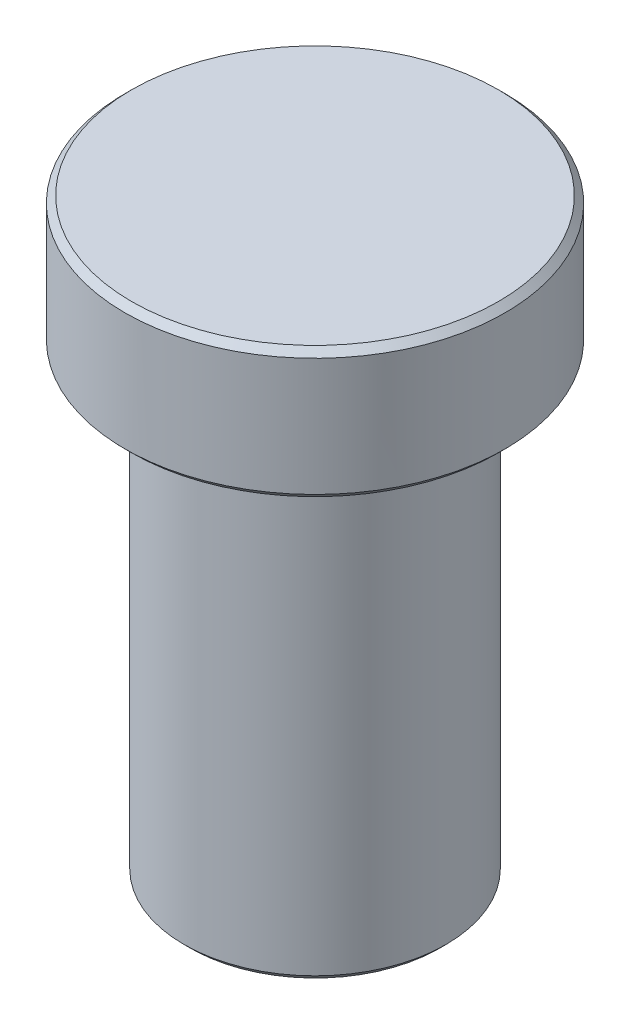
ISO-10303-21;
HEADER;
FILE_DESCRIPTION(('STEP AP214'),'2;1');
FILE_NAME('part.step','',(''),(''),'','','');
FILE_SCHEMA(('AUTOMOTIVE_DESIGN { 1 0 10303 214 1 1 1 1 }'));
ENDSEC;
DATA;
#1=APPLICATION_CONTEXT('core data for automotive mechanical design processes');
#2=APPLICATION_PROTOCOL_DEFINITION('international standard','automotive_design',2000,#1);
#3=PRODUCT_CONTEXT('',#1,'mechanical');
#4=PRODUCT('Part','Part','',(#3));
#5=PRODUCT_RELATED_PRODUCT_CATEGORY('part','',(#4));
#6=PRODUCT_DEFINITION_FORMATION('','',#4);
#7=PRODUCT_DEFINITION_CONTEXT('part definition',#1,'design');
#8=PRODUCT_DEFINITION('design','',#6,#7);
#9=PRODUCT_DEFINITION_SHAPE('','',#8);
#10=(LENGTH_UNIT() NAMED_UNIT(*) SI_UNIT(.MILLI.,.METRE.));
#11=(NAMED_UNIT(*) PLANE_ANGLE_UNIT() SI_UNIT($,.RADIAN.));
#12=(NAMED_UNIT(*) SI_UNIT($,.STERADIAN.) SOLID_ANGLE_UNIT());
#13=UNCERTAINTY_MEASURE_WITH_UNIT(LENGTH_MEASURE(1.E-05),#10,'distance_accuracy_value','');
#14=(GEOMETRIC_REPRESENTATION_CONTEXT(3) GLOBAL_UNCERTAINTY_ASSIGNED_CONTEXT((#13)) GLOBAL_UNIT_ASSIGNED_CONTEXT((#10,
#11,#12)) REPRESENTATION_CONTEXT('',''));
#15=CARTESIAN_POINT('',(0.,0.,0.));
#16=DIRECTION('',(0.,0.,1.));
#17=DIRECTION('',(1.,0.,0.));
#18=AXIS2_PLACEMENT_3D('',#15,#16,#17);
#19=CARTESIAN_POINT('',(2.,0.,0.));
#20=DIRECTION('',(0.,-1.,0.));
#21=DIRECTION('',(0.,0.,-1.));
#22=AXIS2_PLACEMENT_3D('',#19,#20,#21);
#23=PLANE('',#22);
#24=CARTESIAN_POINT('',(0.,0.,0.));
#25=DIRECTION('',(0.,-1.,0.));
#26=DIRECTION('',(0.,0.,-1.));
#27=AXIS2_PLACEMENT_3D('',#24,#25,#26);
#28=CIRCLE('',#27,1.9);
#29=CARTESIAN_POINT('',(0.,0.,-1.9));
#30=VERTEX_POINT('',#29);
#31=EDGE_CURVE('E42',#30,#30,#28,.T.);
#32=ORIENTED_EDGE('',*,*,#31,.T.);
#33=EDGE_LOOP('',(#32));
#34=FACE_BOUND('',#33,.T.);
#35=ADVANCED_FACE('F31',(#34),#23,.T.);
#36=CARTESIAN_POINT('',(0.,9.,0.));
#37=DIRECTION('',(0.,1.,0.));
#38=DIRECTION('',(0.,0.,1.));
#39=AXIS2_PLACEMENT_3D('',#36,#37,#38);
#40=PLANE('',#39);
#41=CARTESIAN_POINT('',(0.,9.,0.));
#42=DIRECTION('',(0.,1.,0.));
#43=DIRECTION('',(0.,0.,1.));
#44=AXIS2_PLACEMENT_3D('',#41,#42,#43);
#45=CIRCLE('',#44,2.8);
#46=CARTESIAN_POINT('',(0.,9.,2.8));
#47=VERTEX_POINT('',#46);
#48=EDGE_CURVE('E10',#47,#47,#45,.T.);
#49=ORIENTED_EDGE('',*,*,#48,.T.);
#50=EDGE_LOOP('',(#49));
#51=FACE_BOUND('',#50,.T.);
#52=ADVANCED_FACE('F74',(#51),#40,.T.);
#53=CARTESIAN_POINT('',(0.,0.,0.));
#54=DIRECTION('',(0.,-1.,0.));
#55=DIRECTION('',(0.,0.,-1.));
#56=AXIS2_PLACEMENT_3D('',#53,#54,#55);
#57=CYLINDRICAL_SURFACE('',#56,2.9);
#58=CARTESIAN_POINT('',(0.,7.1,0.));
#59=DIRECTION('',(0.,-1.,0.));
#60=DIRECTION('',(0.,0.,-1.));
#61=AXIS2_PLACEMENT_3D('',#58,#59,#60);
#62=CIRCLE('',#61,2.9);
#63=CARTESIAN_POINT('',(0.,7.1,-2.9));
#64=VERTEX_POINT('',#63);
#65=EDGE_CURVE('E46',#64,#64,#62,.F.);
#66=ORIENTED_EDGE('',*,*,#65,.T.);
#67=EDGE_LOOP('',(#66));
#68=FACE_BOUND('',#67,.T.);
#69=CARTESIAN_POINT('',(0.,8.9,0.));
#70=DIRECTION('',(0.,1.,0.));
#71=DIRECTION('',(0.,0.,1.));
#72=AXIS2_PLACEMENT_3D('',#69,#70,#71);
#73=CIRCLE('',#72,2.9);
#74=CARTESIAN_POINT('',(0.,8.9,2.9));
#75=VERTEX_POINT('',#74);
#76=EDGE_CURVE('E51',#75,#75,#73,.F.);
#77=ORIENTED_EDGE('',*,*,#76,.T.);
#78=EDGE_LOOP('',(#77));
#79=FACE_BOUND('',#78,.T.);
#80=ADVANCED_FACE('F65',(#68,#79),#57,.T.);
#81=CARTESIAN_POINT('',(2.9,7.,0.));
#82=DIRECTION('',(0.,-1.,0.));
#83=DIRECTION('',(0.,0.,-1.));
#84=AXIS2_PLACEMENT_3D('',#81,#82,#83);
#85=PLANE('',#84);
#86=CARTESIAN_POINT('',(0.,7.,0.));
#87=DIRECTION('',(0.,-1.,0.));
#88=DIRECTION('',(0.,0.,-1.));
#89=AXIS2_PLACEMENT_3D('',#86,#87,#88);
#90=CIRCLE('',#89,2.79999999999999);
#91=CARTESIAN_POINT('',(0.,7.,-2.79999999999999));
#92=VERTEX_POINT('',#91);
#93=EDGE_CURVE('E54',#92,#92,#90,.T.);
#94=ORIENTED_EDGE('',*,*,#93,.T.);
#95=EDGE_LOOP('',(#94));
#96=FACE_BOUND('',#95,.T.);
#97=CARTESIAN_POINT('',(0.,7.,0.));
#98=DIRECTION('',(0.,-1.,0.));
#99=DIRECTION('',(0.,0.,-1.));
#100=AXIS2_PLACEMENT_3D('',#97,#98,#99);
#101=CIRCLE('',#100,2.);
#102=CARTESIAN_POINT('',(0.,7.,-2.));
#103=VERTEX_POINT('',#102);
#104=EDGE_CURVE('E57',#103,#103,#101,.T.);
#105=ORIENTED_EDGE('',*,*,#104,.F.);
#106=EDGE_LOOP('',(#105));
#107=FACE_BOUND('',#106,.T.);
#108=ADVANCED_FACE('F63',(#96,#107),#85,.T.);
#109=CARTESIAN_POINT('',(0.,0.,0.));
#110=DIRECTION('',(0.,-1.,0.));
#111=DIRECTION('',(0.,0.,-1.));
#112=AXIS2_PLACEMENT_3D('',#109,#110,#111);
#113=CYLINDRICAL_SURFACE('',#112,2.);
#114=CARTESIAN_POINT('',(0.,0.100000000000001,0.));
#115=DIRECTION('',(0.,-1.,0.));
#116=DIRECTION('',(0.,0.,-1.));
#117=AXIS2_PLACEMENT_3D('',#114,#115,#116);
#118=CIRCLE('',#117,2.);
#119=CARTESIAN_POINT('',(0.,0.100000000000001,-2.));
#120=VERTEX_POINT('',#119);
#121=EDGE_CURVE('E38',#120,#120,#118,.F.);
#122=ORIENTED_EDGE('',*,*,#121,.T.);
#123=EDGE_LOOP('',(#122));
#124=FACE_BOUND('',#123,.T.);
#125=ORIENTED_EDGE('',*,*,#104,.T.);
#126=EDGE_LOOP('',(#125));
#127=FACE_BOUND('',#126,.T.);
#128=ADVANCED_FACE('F61',(#124,#127),#113,.T.);
#129=CARTESIAN_POINT('',(0.,7.,0.));
#130=DIRECTION('',(0.,1.,0.));
#131=DIRECTION('',(0.,0.,1.));
#132=AXIS2_PLACEMENT_3D('',#129,#130,#131);
#133=CONICAL_SURFACE('',#132,2.79999999999999,0.78539816339745);
#134=ORIENTED_EDGE('',*,*,#65,.F.);
#135=EDGE_LOOP('',(#134));
#136=FACE_BOUND('',#135,.T.);
#137=ORIENTED_EDGE('',*,*,#93,.F.);
#138=EDGE_LOOP('',(#137));
#139=FACE_BOUND('',#138,.T.);
#140=ADVANCED_FACE('F72',(#136,#139),#133,.T.);
#141=CARTESIAN_POINT('',(0.,0.,0.));
#142=DIRECTION('',(0.,1.,0.));
#143=DIRECTION('',(0.,0.,1.));
#144=AXIS2_PLACEMENT_3D('',#141,#142,#143);
#145=CONICAL_SURFACE('',#144,1.9,0.785398163397438);
#146=ORIENTED_EDGE('',*,*,#121,.F.);
#147=EDGE_LOOP('',(#146));
#148=FACE_BOUND('',#147,.T.);
#149=ORIENTED_EDGE('',*,*,#31,.F.);
#150=EDGE_LOOP('',(#149));
#151=FACE_BOUND('',#150,.T.);
#152=ADVANCED_FACE('F86',(#148,#151),#145,.T.);
#153=CARTESIAN_POINT('',(0.,8.9,0.));
#154=DIRECTION('',(0.,-1.,0.));
#155=DIRECTION('',(0.,0.,-1.));
#156=AXIS2_PLACEMENT_3D('',#153,#154,#155);
#157=CONICAL_SURFACE('',#156,2.9,0.78539816339744);
#158=ORIENTED_EDGE('',*,*,#48,.F.);
#159=EDGE_LOOP('',(#158));
#160=FACE_BOUND('',#159,.T.);
#161=ORIENTED_EDGE('',*,*,#76,.F.);
#162=EDGE_LOOP('',(#161));
#163=FACE_BOUND('',#162,.T.);
#164=ADVANCED_FACE('F33',(#160,#163),#157,.T.);
#165=CLOSED_SHELL('',(#35,#52,#80,#108,#128,#140,#152,#164));
#166=MANIFOLD_SOLID_BREP('B2',#165);
#167=ADVANCED_BREP_SHAPE_REPRESENTATION('',(#18,#166),#14);
#168=SHAPE_DEFINITION_REPRESENTATION(#9,#167);
ENDSEC;
END-ISO-10303-21;
